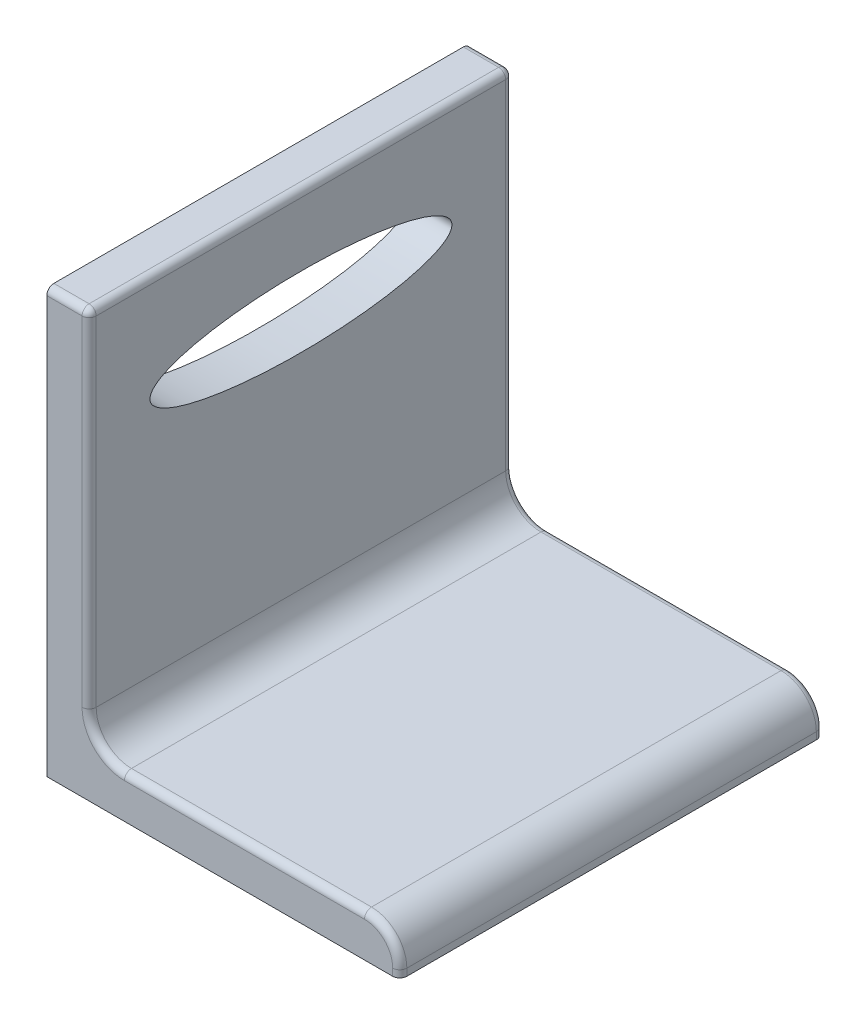
ISO-10303-21;
HEADER;
FILE_DESCRIPTION(('STEP AP214'),'2;1');
FILE_NAME('part.step','',(''),(''),'','','');
FILE_SCHEMA(('AUTOMOTIVE_DESIGN { 1 0 10303 214 1 1 1 1 }'));
ENDSEC;
DATA;
#1=APPLICATION_CONTEXT('core data for automotive mechanical design processes');
#2=APPLICATION_PROTOCOL_DEFINITION('international standard','automotive_design',2000,#1);
#3=PRODUCT_CONTEXT('',#1,'mechanical');
#4=PRODUCT('Part','Part','',(#3));
#5=PRODUCT_RELATED_PRODUCT_CATEGORY('part','',(#4));
#6=PRODUCT_DEFINITION_FORMATION('','',#4);
#7=PRODUCT_DEFINITION_CONTEXT('part definition',#1,'design');
#8=PRODUCT_DEFINITION('design','',#6,#7);
#9=PRODUCT_DEFINITION_SHAPE('','',#8);
#10=(LENGTH_UNIT() NAMED_UNIT(*) SI_UNIT(.MILLI.,.METRE.));
#11=(NAMED_UNIT(*) PLANE_ANGLE_UNIT() SI_UNIT($,.RADIAN.));
#12=(NAMED_UNIT(*) SI_UNIT($,.STERADIAN.) SOLID_ANGLE_UNIT());
#13=UNCERTAINTY_MEASURE_WITH_UNIT(LENGTH_MEASURE(1.E-05),#10,'distance_accuracy_value','');
#14=(GEOMETRIC_REPRESENTATION_CONTEXT(3) GLOBAL_UNCERTAINTY_ASSIGNED_CONTEXT((#13)) GLOBAL_UNIT_ASSIGNED_CONTEXT((#10,
#11,#12)) REPRESENTATION_CONTEXT('',''));
#15=CARTESIAN_POINT('',(0.,0.,0.));
#16=DIRECTION('',(0.,0.,1.));
#17=DIRECTION('',(1.,0.,0.));
#18=AXIS2_PLACEMENT_3D('',#15,#16,#17);
#19=CARTESIAN_POINT('',(0.,0.,-120.));
#20=DIRECTION('',(1.,0.,0.));
#21=DIRECTION('',(0.,0.,-1.));
#22=AXIS2_PLACEMENT_3D('',#19,#20,#21);
#23=PLANE('',#22);
#24=CARTESIAN_POINT('',(0.,90.,-60.));
#25=DIRECTION('',(-1.,0.,0.));
#26=DIRECTION('',(0.,0.,1.));
#27=AXIS2_PLACEMENT_3D('',#24,#25,#26);
#28=ELLIPSE('',#27,42.771597921815,9.99999999999999);
#29=CARTESIAN_POINT('',(0.,90.,-17.228402078185));
#30=VERTEX_POINT('',#29);
#31=EDGE_CURVE('E237',#30,#30,#28,.T.);
#32=ORIENTED_EDGE('',*,*,#31,.F.);
#33=EDGE_LOOP('',(#32));
#34=FACE_BOUND('',#33,.T.);
#35=DIRECTION('',(0.,0.,1.));
#36=VECTOR('',#35,1.);
#37=CARTESIAN_POINT('',(0.,120.,-120.));
#38=LINE('',#37,#36);
#39=CARTESIAN_POINT('',(0.,120.,-118.));
#40=VERTEX_POINT('',#39);
#41=CARTESIAN_POINT('',(0.,120.,-2.));
#42=VERTEX_POINT('',#41);
#43=EDGE_CURVE('E184',#40,#42,#38,.T.);
#44=ORIENTED_EDGE('',*,*,#43,.F.);
#45=CARTESIAN_POINT('',(0.,118.,-118.));
#46=DIRECTION('',(1.,0.,0.));
#47=DIRECTION('',(0.,0.,-1.));
#48=AXIS2_PLACEMENT_3D('',#45,#46,#47);
#49=CIRCLE('',#48,2.);
#50=CARTESIAN_POINT('',(0.,118.,-120.));
#51=VERTEX_POINT('',#50);
#52=EDGE_CURVE('E169',#40,#51,#49,.F.);
#53=ORIENTED_EDGE('',*,*,#52,.T.);
#54=DIRECTION('',(0.,1.,0.));
#55=VECTOR('',#54,1.);
#56=CARTESIAN_POINT('',(0.,0.,-120.));
#57=LINE('',#56,#55);
#58=CARTESIAN_POINT('',(0.,0.,-120.));
#59=VERTEX_POINT('',#58);
#60=EDGE_CURVE('E166',#59,#51,#57,.T.);
#61=ORIENTED_EDGE('',*,*,#60,.F.);
#62=DIRECTION('',(0.,0.,1.));
#63=VECTOR('',#62,1.);
#64=CARTESIAN_POINT('',(0.,0.,-120.));
#65=LINE('',#64,#63);
#66=CARTESIAN_POINT('',(0.,0.,0.));
#67=VERTEX_POINT('',#66);
#68=EDGE_CURVE('E152',#59,#67,#65,.T.);
#69=ORIENTED_EDGE('',*,*,#68,.T.);
#70=DIRECTION('',(0.,1.,0.));
#71=VECTOR('',#70,1.);
#72=CARTESIAN_POINT('',(0.,0.,0.));
#73=LINE('',#72,#71);
#74=CARTESIAN_POINT('',(0.,118.,0.));
#75=VERTEX_POINT('',#74);
#76=EDGE_CURVE('E180',#67,#75,#73,.T.);
#77=ORIENTED_EDGE('',*,*,#76,.T.);
#78=CARTESIAN_POINT('',(0.,118.,-2.));
#79=DIRECTION('',(1.,0.,0.));
#80=DIRECTION('',(0.,0.,-1.));
#81=AXIS2_PLACEMENT_3D('',#78,#79,#80);
#82=CIRCLE('',#81,2.);
#83=EDGE_CURVE('E277',#75,#42,#82,.F.);
#84=ORIENTED_EDGE('',*,*,#83,.T.);
#85=EDGE_LOOP('',(#44,#53,#61,#69,#77,#84));
#86=FACE_BOUND('',#85,.T.);
#87=ADVANCED_FACE('F37',(#34,#86),#23,.F.);
#88=CARTESIAN_POINT('',(0.,120.,-120.));
#89=DIRECTION('',(0.,-1.,0.));
#90=DIRECTION('',(0.,0.,-1.));
#91=AXIS2_PLACEMENT_3D('',#88,#89,#90);
#92=PLANE('',#91);
#93=DIRECTION('',(0.,0.,1.));
#94=VECTOR('',#93,1.);
#95=CARTESIAN_POINT('',(10.,120.,-118.));
#96=LINE('',#95,#94);
#97=CARTESIAN_POINT('',(10.,120.,-2.));
#98=VERTEX_POINT('',#97);
#99=CARTESIAN_POINT('',(10.,120.,-118.));
#100=VERTEX_POINT('',#99);
#101=EDGE_CURVE('E273',#98,#100,#96,.F.);
#102=ORIENTED_EDGE('',*,*,#101,.T.);
#103=DIRECTION('',(1.,0.,0.));
#104=VECTOR('',#103,1.);
#105=CARTESIAN_POINT('',(0.,120.,-118.));
#106=LINE('',#105,#104);
#107=EDGE_CURVE('E275',#100,#40,#106,.F.);
#108=ORIENTED_EDGE('',*,*,#107,.T.);
#109=ORIENTED_EDGE('',*,*,#43,.T.);
#110=DIRECTION('',(1.,0.,0.));
#111=VECTOR('',#110,1.);
#112=CARTESIAN_POINT('',(10.,120.,-2.));
#113=LINE('',#112,#111);
#114=EDGE_CURVE('E271',#42,#98,#113,.T.);
#115=ORIENTED_EDGE('',*,*,#114,.T.);
#116=EDGE_LOOP('',(#102,#108,#109,#115));
#117=FACE_BOUND('',#116,.T.);
#118=ADVANCED_FACE('F304',(#117),#92,.F.);
#119=CARTESIAN_POINT('',(12.,0.,-120.));
#120=DIRECTION('',(1.,0.,0.));
#121=DIRECTION('',(0.,0.,-1.));
#122=AXIS2_PLACEMENT_3D('',#119,#120,#121);
#123=PLANE('',#122);
#124=CARTESIAN_POINT('',(12.,90.,-60.));
#125=DIRECTION('',(-1.,0.,0.));
#126=DIRECTION('',(0.,0.,1.));
#127=AXIS2_PLACEMENT_3D('',#124,#125,#126);
#128=ELLIPSE('',#127,42.771597921815,9.99999999999999);
#129=CARTESIAN_POINT('',(12.,90.,-17.228402078185));
#130=VERTEX_POINT('',#129);
#131=EDGE_CURVE('E182',#130,#130,#128,.T.);
#132=ORIENTED_EDGE('',*,*,#131,.T.);
#133=EDGE_LOOP('',(#132));
#134=FACE_BOUND('',#133,.T.);
#135=DIRECTION('',(0.,1.,0.));
#136=VECTOR('',#135,1.);
#137=CARTESIAN_POINT('',(12.,120.,-118.));
#138=LINE('',#137,#136);
#139=CARTESIAN_POINT('',(12.,22.,-118.));
#140=VERTEX_POINT('',#139);
#141=CARTESIAN_POINT('',(12.,118.,-118.));
#142=VERTEX_POINT('',#141);
#143=EDGE_CURVE('E224',#140,#142,#138,.T.);
#144=ORIENTED_EDGE('',*,*,#143,.T.);
#145=DIRECTION('',(0.,0.,1.));
#146=VECTOR('',#145,1.);
#147=CARTESIAN_POINT('',(12.,118.,-2.));
#148=LINE('',#147,#146);
#149=CARTESIAN_POINT('',(12.,118.,-2.));
#150=VERTEX_POINT('',#149);
#151=EDGE_CURVE('E61',#142,#150,#148,.T.);
#152=ORIENTED_EDGE('',*,*,#151,.T.);
#153=DIRECTION('',(0.,1.,0.));
#154=VECTOR('',#153,1.);
#155=CARTESIAN_POINT('',(12.,0.,-2.));
#156=LINE('',#155,#154);
#157=CARTESIAN_POINT('',(12.,22.,-2.));
#158=VERTEX_POINT('',#157);
#159=EDGE_CURVE('E214',#150,#158,#156,.F.);
#160=ORIENTED_EDGE('',*,*,#159,.T.);
#161=DIRECTION('',(0.,0.,1.));
#162=VECTOR('',#161,1.);
#163=CARTESIAN_POINT('',(12.,22.,-120.));
#164=LINE('',#163,#162);
#165=EDGE_CURVE('E195',#158,#140,#164,.F.);
#166=ORIENTED_EDGE('',*,*,#165,.T.);
#167=EDGE_LOOP('',(#144,#152,#160,#166));
#168=FACE_BOUND('',#167,.T.);
#169=ADVANCED_FACE('F371',(#134,#168),#123,.T.);
#170=CARTESIAN_POINT('',(0.,12.,-120.));
#171=DIRECTION('',(0.,-1.,0.));
#172=DIRECTION('',(0.,0.,-1.));
#173=AXIS2_PLACEMENT_3D('',#170,#171,#172);
#174=PLANE('',#173);
#175=DIRECTION('',(0.,0.,1.));
#176=VECTOR('',#175,1.);
#177=CARTESIAN_POINT('',(90.,12.,-120.));
#178=LINE('',#177,#176);
#179=CARTESIAN_POINT('',(90.,12.,-2.));
#180=VERTEX_POINT('',#179);
#181=CARTESIAN_POINT('',(90.,12.,-118.));
#182=VERTEX_POINT('',#181);
#183=EDGE_CURVE('E190',#180,#182,#178,.F.);
#184=ORIENTED_EDGE('',*,*,#183,.T.);
#185=DIRECTION('',(1.,0.,0.));
#186=VECTOR('',#185,1.);
#187=CARTESIAN_POINT('',(0.,12.,-118.));
#188=LINE('',#187,#186);
#189=CARTESIAN_POINT('',(22.,12.,-118.));
#190=VERTEX_POINT('',#189);
#191=EDGE_CURVE('E250',#182,#190,#188,.F.);
#192=ORIENTED_EDGE('',*,*,#191,.T.);
#193=DIRECTION('',(0.,0.,1.));
#194=VECTOR('',#193,1.);
#195=CARTESIAN_POINT('',(22.,12.,-120.));
#196=LINE('',#195,#194);
#197=CARTESIAN_POINT('',(22.,12.,-2.));
#198=VERTEX_POINT('',#197);
#199=EDGE_CURVE('E193',#190,#198,#196,.T.);
#200=ORIENTED_EDGE('',*,*,#199,.T.);
#201=DIRECTION('',(1.,0.,0.));
#202=VECTOR('',#201,1.);
#203=CARTESIAN_POINT('',(90.,12.,-2.));
#204=LINE('',#203,#202);
#205=EDGE_CURVE('E219',#198,#180,#204,.T.);
#206=ORIENTED_EDGE('',*,*,#205,.T.);
#207=EDGE_LOOP('',(#184,#192,#200,#206));
#208=FACE_BOUND('',#207,.T.);
#209=ADVANCED_FACE('F361',(#208),#174,.F.);
#210=CARTESIAN_POINT('',(100.,0.,-120.));
#211=DIRECTION('',(1.,0.,0.));
#212=DIRECTION('',(0.,0.,-1.));
#213=AXIS2_PLACEMENT_3D('',#210,#211,#212);
#214=PLANE('',#213);
#215=DIRECTION('',(0.,0.,1.));
#216=VECTOR('',#215,1.);
#217=CARTESIAN_POINT('',(100.,0.,-120.));
#218=LINE('',#217,#216);
#219=CARTESIAN_POINT('',(100.,0.,-118.));
#220=VERTEX_POINT('',#219);
#221=CARTESIAN_POINT('',(100.,0.,-2.));
#222=VERTEX_POINT('',#221);
#223=EDGE_CURVE('E163',#220,#222,#218,.T.);
#224=ORIENTED_EDGE('',*,*,#223,.F.);
#225=DIRECTION('',(0.,1.,0.));
#226=VECTOR('',#225,1.);
#227=CARTESIAN_POINT('',(100.,2.,-118.));
#228=LINE('',#227,#226);
#229=CARTESIAN_POINT('',(100.,2.,-118.));
#230=VERTEX_POINT('',#229);
#231=EDGE_CURVE('E252',#220,#230,#228,.T.);
#232=ORIENTED_EDGE('',*,*,#231,.T.);
#233=DIRECTION('',(0.,0.,1.));
#234=VECTOR('',#233,1.);
#235=CARTESIAN_POINT('',(100.,2.,0.));
#236=LINE('',#235,#234);
#237=CARTESIAN_POINT('',(100.,2.,-2.));
#238=VERTEX_POINT('',#237);
#239=EDGE_CURVE('E187',#230,#238,#236,.T.);
#240=ORIENTED_EDGE('',*,*,#239,.T.);
#241=DIRECTION('',(0.,1.,0.));
#242=VECTOR('',#241,1.);
#243=CARTESIAN_POINT('',(100.,0.,-2.));
#244=LINE('',#243,#242);
#245=EDGE_CURVE('E209',#238,#222,#244,.F.);
#246=ORIENTED_EDGE('',*,*,#245,.T.);
#247=EDGE_LOOP('',(#224,#232,#240,#246));
#248=FACE_BOUND('',#247,.T.);
#249=ADVANCED_FACE('F338',(#248),#214,.T.);
#250=CARTESIAN_POINT('',(0.,0.,-120.));
#251=DIRECTION('',(0.,-1.,0.));
#252=DIRECTION('',(0.,0.,-1.));
#253=AXIS2_PLACEMENT_3D('',#250,#251,#252);
#254=PLANE('',#253);
#255=DIRECTION('',(1.,0.,0.));
#256=VECTOR('',#255,1.);
#257=CARTESIAN_POINT('',(0.,0.,-120.));
#258=LINE('',#257,#256);
#259=CARTESIAN_POINT('',(98.,0.,-120.));
#260=VERTEX_POINT('',#259);
#261=EDGE_CURVE('E156',#59,#260,#258,.T.);
#262=ORIENTED_EDGE('',*,*,#261,.T.);
#263=CARTESIAN_POINT('',(98.,0.,-118.));
#264=DIRECTION('',(0.,-1.,0.));
#265=DIRECTION('',(0.,0.,-1.));
#266=AXIS2_PLACEMENT_3D('',#263,#264,#265);
#267=CIRCLE('',#266,2.);
#268=EDGE_CURVE('E254',#260,#220,#267,.T.);
#269=ORIENTED_EDGE('',*,*,#268,.T.);
#270=ORIENTED_EDGE('',*,*,#223,.T.);
#271=CARTESIAN_POINT('',(98.,0.,-2.));
#272=DIRECTION('',(0.,-1.,0.));
#273=DIRECTION('',(0.,0.,-1.));
#274=AXIS2_PLACEMENT_3D('',#271,#272,#273);
#275=CIRCLE('',#274,2.);
#276=CARTESIAN_POINT('',(98.,0.,0.));
#277=VERTEX_POINT('',#276);
#278=EDGE_CURVE('E212',#222,#277,#275,.T.);
#279=ORIENTED_EDGE('',*,*,#278,.T.);
#280=DIRECTION('',(1.,0.,0.));
#281=VECTOR('',#280,1.);
#282=CARTESIAN_POINT('',(0.,0.,0.));
#283=LINE('',#282,#281);
#284=EDGE_CURVE('E159',#67,#277,#283,.T.);
#285=ORIENTED_EDGE('',*,*,#284,.F.);
#286=ORIENTED_EDGE('',*,*,#68,.F.);
#287=EDGE_LOOP('',(#262,#269,#270,#279,#285,#286));
#288=FACE_BOUND('',#287,.T.);
#289=ADVANCED_FACE('F154',(#288),#254,.T.);
#290=CARTESIAN_POINT('',(0.,0.,-120.));
#291=DIRECTION('',(0.,0.,1.));
#292=DIRECTION('',(1.,0.,0.));
#293=AXIS2_PLACEMENT_3D('',#290,#291,#292);
#294=PLANE('',#293);
#295=ORIENTED_EDGE('',*,*,#60,.T.);
#296=DIRECTION('',(1.,0.,0.));
#297=VECTOR('',#296,1.);
#298=CARTESIAN_POINT('',(0.,118.,-120.));
#299=LINE('',#298,#297);
#300=CARTESIAN_POINT('',(10.,118.,-120.));
#301=VERTEX_POINT('',#300);
#302=EDGE_CURVE('E258',#51,#301,#299,.T.);
#303=ORIENTED_EDGE('',*,*,#302,.T.);
#304=DIRECTION('',(0.,1.,0.));
#305=VECTOR('',#304,1.);
#306=CARTESIAN_POINT('',(10.,22.,-120.));
#307=LINE('',#306,#305);
#308=CARTESIAN_POINT('',(10.,22.,-120.));
#309=VERTEX_POINT('',#308);
#310=EDGE_CURVE('E246',#301,#309,#307,.F.);
#311=ORIENTED_EDGE('',*,*,#310,.T.);
#312=CARTESIAN_POINT('',(22.,22.,-120.));
#313=DIRECTION('',(0.,0.,1.));
#314=DIRECTION('',(1.,0.,0.));
#315=AXIS2_PLACEMENT_3D('',#312,#313,#314);
#316=CIRCLE('',#315,12.);
#317=CARTESIAN_POINT('',(22.,10.,-120.));
#318=VERTEX_POINT('',#317);
#319=EDGE_CURVE('E244',#309,#318,#316,.T.);
#320=ORIENTED_EDGE('',*,*,#319,.T.);
#321=DIRECTION('',(1.,0.,0.));
#322=VECTOR('',#321,1.);
#323=CARTESIAN_POINT('',(0.,10.,-120.));
#324=LINE('',#323,#322);
#325=CARTESIAN_POINT('',(90.,10.,-120.));
#326=VERTEX_POINT('',#325);
#327=EDGE_CURVE('E242',#318,#326,#324,.T.);
#328=ORIENTED_EDGE('',*,*,#327,.T.);
#329=CARTESIAN_POINT('',(90.,2.,-120.));
#330=DIRECTION('',(0.,0.,1.));
#331=DIRECTION('',(1.,0.,0.));
#332=AXIS2_PLACEMENT_3D('',#329,#330,#331);
#333=CIRCLE('',#332,8.);
#334=CARTESIAN_POINT('',(98.,2.,-120.));
#335=VERTEX_POINT('',#334);
#336=EDGE_CURVE('E239',#326,#335,#333,.F.);
#337=ORIENTED_EDGE('',*,*,#336,.T.);
#338=DIRECTION('',(0.,1.,0.));
#339=VECTOR('',#338,1.);
#340=CARTESIAN_POINT('',(98.,0.,-120.));
#341=LINE('',#340,#339);
#342=EDGE_CURVE('E176',#335,#260,#341,.F.);
#343=ORIENTED_EDGE('',*,*,#342,.T.);
#344=ORIENTED_EDGE('',*,*,#261,.F.);
#345=EDGE_LOOP('',(#295,#303,#311,#320,#328,#337,#343,#344));
#346=FACE_BOUND('',#345,.T.);
#347=ADVANCED_FACE('F174',(#346),#294,.F.);
#348=CARTESIAN_POINT('',(0.,0.,0.));
#349=DIRECTION('',(0.,0.,1.));
#350=DIRECTION('',(1.,0.,0.));
#351=AXIS2_PLACEMENT_3D('',#348,#349,#350);
#352=PLANE('',#351);
#353=DIRECTION('',(0.,1.,0.));
#354=VECTOR('',#353,1.);
#355=CARTESIAN_POINT('',(10.,0.,0.));
#356=LINE('',#355,#354);
#357=CARTESIAN_POINT('',(10.,22.,0.));
#358=VERTEX_POINT('',#357);
#359=CARTESIAN_POINT('',(10.,118.,0.));
#360=VERTEX_POINT('',#359);
#361=EDGE_CURVE('E204',#358,#360,#356,.T.);
#362=ORIENTED_EDGE('',*,*,#361,.T.);
#363=DIRECTION('',(1.,0.,0.));
#364=VECTOR('',#363,1.);
#365=CARTESIAN_POINT('',(0.,118.,0.));
#366=LINE('',#365,#364);
#367=EDGE_CURVE('E11',#360,#75,#366,.F.);
#368=ORIENTED_EDGE('',*,*,#367,.T.);
#369=ORIENTED_EDGE('',*,*,#76,.F.);
#370=ORIENTED_EDGE('',*,*,#284,.T.);
#371=DIRECTION('',(0.,1.,0.));
#372=VECTOR('',#371,1.);
#373=CARTESIAN_POINT('',(98.,0.,0.));
#374=LINE('',#373,#372);
#375=CARTESIAN_POINT('',(98.,2.,0.));
#376=VERTEX_POINT('',#375);
#377=EDGE_CURVE('E206',#277,#376,#374,.T.);
#378=ORIENTED_EDGE('',*,*,#377,.T.);
#379=CARTESIAN_POINT('',(90.,2.,0.));
#380=DIRECTION('',(0.,0.,1.));
#381=DIRECTION('',(1.,0.,0.));
#382=AXIS2_PLACEMENT_3D('',#379,#380,#381);
#383=CIRCLE('',#382,8.);
#384=CARTESIAN_POINT('',(90.,10.,0.));
#385=VERTEX_POINT('',#384);
#386=EDGE_CURVE('E198',#376,#385,#383,.T.);
#387=ORIENTED_EDGE('',*,*,#386,.T.);
#388=DIRECTION('',(1.,0.,0.));
#389=VECTOR('',#388,1.);
#390=CARTESIAN_POINT('',(22.,10.,0.));
#391=LINE('',#390,#389);
#392=CARTESIAN_POINT('',(22.,10.,0.));
#393=VERTEX_POINT('',#392);
#394=EDGE_CURVE('E200',#385,#393,#391,.F.);
#395=ORIENTED_EDGE('',*,*,#394,.T.);
#396=CARTESIAN_POINT('',(22.,22.,0.));
#397=DIRECTION('',(0.,0.,1.));
#398=DIRECTION('',(1.,0.,0.));
#399=AXIS2_PLACEMENT_3D('',#396,#397,#398);
#400=CIRCLE('',#399,12.);
#401=EDGE_CURVE('E202',#393,#358,#400,.F.);
#402=ORIENTED_EDGE('',*,*,#401,.T.);
#403=EDGE_LOOP('',(#362,#368,#369,#370,#378,#387,#395,#402));
#404=FACE_BOUND('',#403,.T.);
#405=ADVANCED_FACE('F302',(#404),#352,.T.);
#406=DIRECTION('',(-1.,0.,0.));
#407=VECTOR('',#406,1.);
#408=SURFACE_OF_LINEAR_EXTRUSION('',#128,#407);
#409=ORIENTED_EDGE('',*,*,#131,.F.);
#410=EDGE_LOOP('',(#409));
#411=FACE_BOUND('',#410,.T.);
#412=ORIENTED_EDGE('',*,*,#31,.T.);
#413=EDGE_LOOP('',(#412));
#414=FACE_BOUND('',#413,.T.);
#415=ADVANCED_FACE('F393',(#411,#414),#408,.F.);
#416=CARTESIAN_POINT('',(90.,2.,-120.));
#417=DIRECTION('',(0.,0.,-1.));
#418=DIRECTION('',(-1.,0.,0.));
#419=AXIS2_PLACEMENT_3D('',#416,#417,#418);
#420=CYLINDRICAL_SURFACE('',#419,10.);
#421=ORIENTED_EDGE('',*,*,#239,.F.);
#422=CARTESIAN_POINT('',(90.,2.,-118.));
#423=DIRECTION('',(0.,0.,1.));
#424=DIRECTION('',(1.,0.,0.));
#425=AXIS2_PLACEMENT_3D('',#422,#423,#424);
#426=CIRCLE('',#425,10.);
#427=EDGE_CURVE('E256',#230,#182,#426,.T.);
#428=ORIENTED_EDGE('',*,*,#427,.T.);
#429=ORIENTED_EDGE('',*,*,#183,.F.);
#430=CARTESIAN_POINT('',(90.,2.,-2.));
#431=DIRECTION('',(0.,0.,1.));
#432=DIRECTION('',(1.,0.,0.));
#433=AXIS2_PLACEMENT_3D('',#430,#431,#432);
#434=CIRCLE('',#433,10.);
#435=EDGE_CURVE('E221',#180,#238,#434,.F.);
#436=ORIENTED_EDGE('',*,*,#435,.T.);
#437=EDGE_LOOP('',(#421,#428,#429,#436));
#438=FACE_BOUND('',#437,.T.);
#439=ADVANCED_FACE('F359',(#438),#420,.T.);
#440=CARTESIAN_POINT('',(22.,22.,-120.));
#441=DIRECTION('',(0.,0.,1.));
#442=DIRECTION('',(1.,0.,0.));
#443=AXIS2_PLACEMENT_3D('',#440,#441,#442);
#444=CYLINDRICAL_SURFACE('',#443,10.);
#445=ORIENTED_EDGE('',*,*,#199,.F.);
#446=CARTESIAN_POINT('',(22.,22.,-118.));
#447=DIRECTION('',(0.,0.,1.));
#448=DIRECTION('',(1.,0.,0.));
#449=AXIS2_PLACEMENT_3D('',#446,#447,#448);
#450=CIRCLE('',#449,10.);
#451=EDGE_CURVE('E248',#190,#140,#450,.F.);
#452=ORIENTED_EDGE('',*,*,#451,.T.);
#453=ORIENTED_EDGE('',*,*,#165,.F.);
#454=CARTESIAN_POINT('',(22.,22.,-2.));
#455=DIRECTION('',(0.,0.,1.));
#456=DIRECTION('',(1.,0.,0.));
#457=AXIS2_PLACEMENT_3D('',#454,#455,#456);
#458=CIRCLE('',#457,10.);
#459=EDGE_CURVE('E216',#158,#198,#458,.T.);
#460=ORIENTED_EDGE('',*,*,#459,.T.);
#461=EDGE_LOOP('',(#445,#452,#453,#460));
#462=FACE_BOUND('',#461,.T.);
#463=ADVANCED_FACE('F366',(#462),#444,.F.);
#464=CARTESIAN_POINT('',(10.,0.,-2.));
#465=DIRECTION('',(0.,1.,0.));
#466=DIRECTION('',(0.,0.,1.));
#467=AXIS2_PLACEMENT_3D('',#464,#465,#466);
#468=CYLINDRICAL_SURFACE('',#467,2.);
#469=ORIENTED_EDGE('',*,*,#159,.F.);
#470=CARTESIAN_POINT('',(10.,118.,-2.));
#471=DIRECTION('',(0.,1.,0.));
#472=DIRECTION('',(0.,0.,1.));
#473=AXIS2_PLACEMENT_3D('',#470,#471,#472);
#474=CIRCLE('',#473,2.);
#475=EDGE_CURVE('E46',#150,#360,#474,.F.);
#476=ORIENTED_EDGE('',*,*,#475,.T.);
#477=ORIENTED_EDGE('',*,*,#361,.F.);
#478=CARTESIAN_POINT('',(10.,22.,-2.));
#479=DIRECTION('',(0.,-1.,0.));
#480=DIRECTION('',(0.,0.,-1.));
#481=AXIS2_PLACEMENT_3D('',#478,#479,#480);
#482=CIRCLE('',#481,2.);
#483=EDGE_CURVE('E234',#158,#358,#482,.T.);
#484=ORIENTED_EDGE('',*,*,#483,.F.);
#485=EDGE_LOOP('',(#469,#476,#477,#484));
#486=FACE_BOUND('',#485,.T.);
#487=ADVANCED_FACE('F370',(#486),#468,.T.);
#488=CARTESIAN_POINT('',(22.,22.,-2.));
#489=DIRECTION('',(0.,0.,1.));
#490=DIRECTION('',(1.,0.,0.));
#491=AXIS2_PLACEMENT_3D('',#488,#489,#490);
#492=TOROIDAL_SURFACE('',#491,12.,2.);
#493=ORIENTED_EDGE('',*,*,#483,.T.);
#494=ORIENTED_EDGE('',*,*,#401,.F.);
#495=CARTESIAN_POINT('',(22.,10.,-2.));
#496=DIRECTION('',(1.,0.,0.));
#497=DIRECTION('',(0.,0.,-1.));
#498=AXIS2_PLACEMENT_3D('',#495,#496,#497);
#499=CIRCLE('',#498,2.);
#500=EDGE_CURVE('E231',#198,#393,#499,.T.);
#501=ORIENTED_EDGE('',*,*,#500,.F.);
#502=ORIENTED_EDGE('',*,*,#459,.F.);
#503=EDGE_LOOP('',(#493,#494,#501,#502));
#504=FACE_BOUND('',#503,.T.);
#505=ADVANCED_FACE('F369',(#504),#492,.T.);
#506=CARTESIAN_POINT('',(0.,10.,-2.));
#507=DIRECTION('',(-1.,0.,0.));
#508=DIRECTION('',(0.,0.,1.));
#509=AXIS2_PLACEMENT_3D('',#506,#507,#508);
#510=CYLINDRICAL_SURFACE('',#509,2.);
#511=ORIENTED_EDGE('',*,*,#500,.T.);
#512=ORIENTED_EDGE('',*,*,#394,.F.);
#513=CARTESIAN_POINT('',(90.,10.,-2.));
#514=DIRECTION('',(1.,0.,0.));
#515=DIRECTION('',(0.,0.,-1.));
#516=AXIS2_PLACEMENT_3D('',#513,#514,#515);
#517=CIRCLE('',#516,2.);
#518=EDGE_CURVE('E227',#180,#385,#517,.T.);
#519=ORIENTED_EDGE('',*,*,#518,.F.);
#520=ORIENTED_EDGE('',*,*,#205,.F.);
#521=EDGE_LOOP('',(#511,#512,#519,#520));
#522=FACE_BOUND('',#521,.T.);
#523=ADVANCED_FACE('F352',(#522),#510,.T.);
#524=CARTESIAN_POINT('',(90.,2.,-2.));
#525=DIRECTION('',(0.,0.,1.));
#526=DIRECTION('',(1.,0.,0.));
#527=AXIS2_PLACEMENT_3D('',#524,#525,#526);
#528=TOROIDAL_SURFACE('',#527,8.,2.);
#529=ORIENTED_EDGE('',*,*,#518,.T.);
#530=ORIENTED_EDGE('',*,*,#386,.F.);
#531=CARTESIAN_POINT('',(98.,2.,-2.));
#532=DIRECTION('',(0.,-1.,0.));
#533=DIRECTION('',(0.,0.,-1.));
#534=AXIS2_PLACEMENT_3D('',#531,#532,#533);
#535=CIRCLE('',#534,2.);
#536=EDGE_CURVE('E225',#238,#376,#535,.T.);
#537=ORIENTED_EDGE('',*,*,#536,.F.);
#538=ORIENTED_EDGE('',*,*,#435,.F.);
#539=EDGE_LOOP('',(#529,#530,#537,#538));
#540=FACE_BOUND('',#539,.T.);
#541=ADVANCED_FACE('F356',(#540),#528,.T.);
#542=CARTESIAN_POINT('',(98.,0.,-2.));
#543=DIRECTION('',(0.,1.,0.));
#544=DIRECTION('',(0.,0.,1.));
#545=AXIS2_PLACEMENT_3D('',#542,#543,#544);
#546=CYLINDRICAL_SURFACE('',#545,2.);
#547=ORIENTED_EDGE('',*,*,#278,.F.);
#548=ORIENTED_EDGE('',*,*,#245,.F.);
#549=ORIENTED_EDGE('',*,*,#536,.T.);
#550=ORIENTED_EDGE('',*,*,#377,.F.);
#551=EDGE_LOOP('',(#547,#548,#549,#550));
#552=FACE_BOUND('',#551,.T.);
#553=ADVANCED_FACE('F345',(#552),#546,.T.);
#554=CARTESIAN_POINT('',(98.,0.,-118.));
#555=DIRECTION('',(0.,-1.,0.));
#556=DIRECTION('',(0.,0.,-1.));
#557=AXIS2_PLACEMENT_3D('',#554,#555,#556);
#558=CYLINDRICAL_SURFACE('',#557,2.);
#559=ORIENTED_EDGE('',*,*,#268,.F.);
#560=ORIENTED_EDGE('',*,*,#342,.F.);
#561=CARTESIAN_POINT('',(98.,2.,-118.));
#562=DIRECTION('',(0.,1.,0.));
#563=DIRECTION('',(0.,0.,1.));
#564=AXIS2_PLACEMENT_3D('',#561,#562,#563);
#565=CIRCLE('',#564,2.);
#566=EDGE_CURVE('E228',#230,#335,#565,.T.);
#567=ORIENTED_EDGE('',*,*,#566,.F.);
#568=ORIENTED_EDGE('',*,*,#231,.F.);
#569=EDGE_LOOP('',(#559,#560,#567,#568));
#570=FACE_BOUND('',#569,.T.);
#571=ADVANCED_FACE('F334',(#570),#558,.T.);
#572=CARTESIAN_POINT('',(90.,2.,-118.));
#573=DIRECTION('',(0.,0.,1.));
#574=DIRECTION('',(1.,0.,0.));
#575=AXIS2_PLACEMENT_3D('',#572,#573,#574);
#576=TOROIDAL_SURFACE('',#575,8.,2.);
#577=ORIENTED_EDGE('',*,*,#566,.T.);
#578=ORIENTED_EDGE('',*,*,#336,.F.);
#579=CARTESIAN_POINT('',(90.,10.,-118.));
#580=DIRECTION('',(-1.,0.,0.));
#581=DIRECTION('',(0.,0.,1.));
#582=AXIS2_PLACEMENT_3D('',#579,#580,#581);
#583=CIRCLE('',#582,2.);
#584=EDGE_CURVE('E265',#182,#326,#583,.T.);
#585=ORIENTED_EDGE('',*,*,#584,.F.);
#586=ORIENTED_EDGE('',*,*,#427,.F.);
#587=EDGE_LOOP('',(#577,#578,#585,#586));
#588=FACE_BOUND('',#587,.T.);
#589=ADVANCED_FACE('F331',(#588),#576,.T.);
#590=CARTESIAN_POINT('',(0.,10.,-118.));
#591=DIRECTION('',(1.,0.,0.));
#592=DIRECTION('',(0.,0.,-1.));
#593=AXIS2_PLACEMENT_3D('',#590,#591,#592);
#594=CYLINDRICAL_SURFACE('',#593,2.);
#595=ORIENTED_EDGE('',*,*,#584,.T.);
#596=ORIENTED_EDGE('',*,*,#327,.F.);
#597=CARTESIAN_POINT('',(22.,10.,-118.));
#598=DIRECTION('',(-1.,0.,0.));
#599=DIRECTION('',(0.,0.,1.));
#600=AXIS2_PLACEMENT_3D('',#597,#598,#599);
#601=CIRCLE('',#600,2.);
#602=EDGE_CURVE('E262',#190,#318,#601,.T.);
#603=ORIENTED_EDGE('',*,*,#602,.F.);
#604=ORIENTED_EDGE('',*,*,#191,.F.);
#605=EDGE_LOOP('',(#595,#596,#603,#604));
#606=FACE_BOUND('',#605,.T.);
#607=ADVANCED_FACE('F326',(#606),#594,.T.);
#608=CARTESIAN_POINT('',(22.,22.,-118.));
#609=DIRECTION('',(0.,0.,1.));
#610=DIRECTION('',(1.,0.,0.));
#611=AXIS2_PLACEMENT_3D('',#608,#609,#610);
#612=TOROIDAL_SURFACE('',#611,12.,2.);
#613=ORIENTED_EDGE('',*,*,#602,.T.);
#614=ORIENTED_EDGE('',*,*,#319,.F.);
#615=CARTESIAN_POINT('',(10.,22.,-118.));
#616=DIRECTION('',(0.,1.,0.));
#617=DIRECTION('',(0.,0.,1.));
#618=AXIS2_PLACEMENT_3D('',#615,#616,#617);
#619=CIRCLE('',#618,2.);
#620=EDGE_CURVE('E259',#140,#309,#619,.T.);
#621=ORIENTED_EDGE('',*,*,#620,.F.);
#622=ORIENTED_EDGE('',*,*,#451,.F.);
#623=EDGE_LOOP('',(#613,#614,#621,#622));
#624=FACE_BOUND('',#623,.T.);
#625=ADVANCED_FACE('F321',(#624),#612,.T.);
#626=CARTESIAN_POINT('',(10.,0.,-118.));
#627=DIRECTION('',(0.,-1.,0.));
#628=DIRECTION('',(0.,0.,-1.));
#629=AXIS2_PLACEMENT_3D('',#626,#627,#628);
#630=CYLINDRICAL_SURFACE('',#629,2.);
#631=ORIENTED_EDGE('',*,*,#310,.F.);
#632=CARTESIAN_POINT('',(10.,118.,-118.));
#633=DIRECTION('',(0.,-1.,0.));
#634=DIRECTION('',(0.,0.,-1.));
#635=AXIS2_PLACEMENT_3D('',#632,#633,#634);
#636=CIRCLE('',#635,2.);
#637=EDGE_CURVE('E280',#301,#142,#636,.T.);
#638=ORIENTED_EDGE('',*,*,#637,.T.);
#639=ORIENTED_EDGE('',*,*,#143,.F.);
#640=ORIENTED_EDGE('',*,*,#620,.T.);
#641=EDGE_LOOP('',(#631,#638,#639,#640));
#642=FACE_BOUND('',#641,.T.);
#643=ADVANCED_FACE('F317',(#642),#630,.T.);
#644=CARTESIAN_POINT('',(0.,118.,-2.));
#645=DIRECTION('',(-1.,0.,0.));
#646=DIRECTION('',(0.,0.,1.));
#647=AXIS2_PLACEMENT_3D('',#644,#645,#646);
#648=CYLINDRICAL_SURFACE('',#647,2.);
#649=ORIENTED_EDGE('',*,*,#83,.F.);
#650=ORIENTED_EDGE('',*,*,#367,.F.);
#651=CARTESIAN_POINT('',(10.,118.,-2.));
#652=DIRECTION('',(1.,0.,0.));
#653=DIRECTION('',(0.,0.,-1.));
#654=AXIS2_PLACEMENT_3D('',#651,#652,#653);
#655=CIRCLE('',#654,2.);
#656=EDGE_CURVE('E41',#98,#360,#655,.T.);
#657=ORIENTED_EDGE('',*,*,#656,.F.);
#658=ORIENTED_EDGE('',*,*,#114,.F.);
#659=EDGE_LOOP('',(#649,#650,#657,#658));
#660=FACE_BOUND('',#659,.T.);
#661=ADVANCED_FACE('F39',(#660),#648,.T.);
#662=CARTESIAN_POINT('',(10.,118.,-2.));
#663=DIRECTION('',(0.,0.,1.));
#664=DIRECTION('',(1.,0.,0.));
#665=AXIS2_PLACEMENT_3D('',#662,#663,#664);
#666=SPHERICAL_SURFACE('',#665,2.);
#667=ORIENTED_EDGE('',*,*,#656,.T.);
#668=ORIENTED_EDGE('',*,*,#475,.F.);
#669=CARTESIAN_POINT('',(10.,118.,-2.));
#670=DIRECTION('',(0.,0.,-1.));
#671=DIRECTION('',(-1.,0.,0.));
#672=AXIS2_PLACEMENT_3D('',#669,#670,#671);
#673=CIRCLE('',#672,2.);
#674=EDGE_CURVE('E288',#98,#150,#673,.T.);
#675=ORIENTED_EDGE('',*,*,#674,.F.);
#676=EDGE_LOOP('',(#667,#668,#675));
#677=FACE_BOUND('',#676,.T.);
#678=ADVANCED_FACE('F296',(#677),#666,.T.);
#679=CARTESIAN_POINT('',(10.,118.,-120.));
#680=DIRECTION('',(0.,0.,-1.));
#681=DIRECTION('',(-1.,0.,0.));
#682=AXIS2_PLACEMENT_3D('',#679,#680,#681);
#683=CYLINDRICAL_SURFACE('',#682,2.);
#684=ORIENTED_EDGE('',*,*,#674,.T.);
#685=ORIENTED_EDGE('',*,*,#151,.F.);
#686=CARTESIAN_POINT('',(10.,118.,-118.));
#687=DIRECTION('',(0.,0.,-1.));
#688=DIRECTION('',(-1.,0.,0.));
#689=AXIS2_PLACEMENT_3D('',#686,#687,#688);
#690=CIRCLE('',#689,2.);
#691=EDGE_CURVE('E286',#100,#142,#690,.T.);
#692=ORIENTED_EDGE('',*,*,#691,.F.);
#693=ORIENTED_EDGE('',*,*,#101,.F.);
#694=EDGE_LOOP('',(#684,#685,#692,#693));
#695=FACE_BOUND('',#694,.T.);
#696=ADVANCED_FACE('F372',(#695),#683,.T.);
#697=CARTESIAN_POINT('',(10.,118.,-118.));
#698=DIRECTION('',(0.,0.,1.));
#699=DIRECTION('',(1.,0.,0.));
#700=AXIS2_PLACEMENT_3D('',#697,#698,#699);
#701=SPHERICAL_SURFACE('',#700,2.);
#702=ORIENTED_EDGE('',*,*,#691,.T.);
#703=ORIENTED_EDGE('',*,*,#637,.F.);
#704=CARTESIAN_POINT('',(10.,118.,-118.));
#705=DIRECTION('',(-1.,0.,0.));
#706=DIRECTION('',(0.,0.,1.));
#707=AXIS2_PLACEMENT_3D('',#704,#705,#706);
#708=CIRCLE('',#707,2.);
#709=EDGE_CURVE('E284',#100,#301,#708,.T.);
#710=ORIENTED_EDGE('',*,*,#709,.F.);
#711=EDGE_LOOP('',(#702,#703,#710));
#712=FACE_BOUND('',#711,.T.);
#713=ADVANCED_FACE('F312',(#712),#701,.T.);
#714=CARTESIAN_POINT('',(0.,118.,-118.));
#715=DIRECTION('',(1.,0.,0.));
#716=DIRECTION('',(0.,0.,-1.));
#717=AXIS2_PLACEMENT_3D('',#714,#715,#716);
#718=CYLINDRICAL_SURFACE('',#717,2.);
#719=ORIENTED_EDGE('',*,*,#52,.F.);
#720=ORIENTED_EDGE('',*,*,#107,.F.);
#721=ORIENTED_EDGE('',*,*,#709,.T.);
#722=ORIENTED_EDGE('',*,*,#302,.F.);
#723=EDGE_LOOP('',(#719,#720,#721,#722));
#724=FACE_BOUND('',#723,.T.);
#725=ADVANCED_FACE('F309',(#724),#718,.T.);
#726=CLOSED_SHELL('',(#87,#118,#169,#209,#249,#289,#347,#405,#415,#439,#463,#487,#505,#523,#541,
#553,#571,#589,#607,#625,#643,#661,#678,#696,#713,#725));
#727=MANIFOLD_SOLID_BREP('B2',#726);
#728=ADVANCED_BREP_SHAPE_REPRESENTATION('',(#18,#727),#14);
#729=SHAPE_DEFINITION_REPRESENTATION(#9,#728);
ENDSEC;
END-ISO-10303-21;
